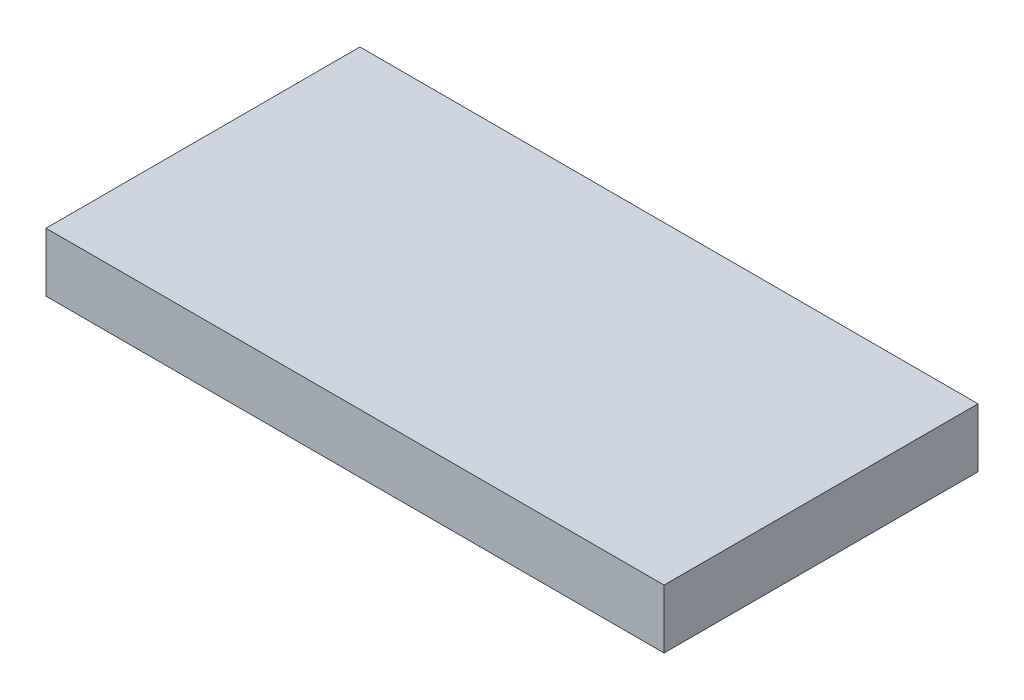
ISO-10303-21;
HEADER;
FILE_DESCRIPTION(('STEP AP214'),'2;1');
FILE_NAME('part.step','',(''),(''),'','','');
FILE_SCHEMA(('AUTOMOTIVE_DESIGN { 1 0 10303 214 1 1 1 1 }'));
ENDSEC;
DATA;
#1=APPLICATION_CONTEXT('core data for automotive mechanical design processes');
#2=APPLICATION_PROTOCOL_DEFINITION('international standard','automotive_design',2000,#1);
#3=PRODUCT_CONTEXT('',#1,'mechanical');
#4=PRODUCT('Part','Part','',(#3));
#5=PRODUCT_RELATED_PRODUCT_CATEGORY('part','',(#4));
#6=PRODUCT_DEFINITION_FORMATION('','',#4);
#7=PRODUCT_DEFINITION_CONTEXT('part definition',#1,'design');
#8=PRODUCT_DEFINITION('design','',#6,#7);
#9=PRODUCT_DEFINITION_SHAPE('','',#8);
#10=(LENGTH_UNIT() NAMED_UNIT(*) SI_UNIT(.MILLI.,.METRE.));
#11=(NAMED_UNIT(*) PLANE_ANGLE_UNIT() SI_UNIT($,.RADIAN.));
#12=(NAMED_UNIT(*) SI_UNIT($,.STERADIAN.) SOLID_ANGLE_UNIT());
#13=UNCERTAINTY_MEASURE_WITH_UNIT(LENGTH_MEASURE(1.E-05),#10,'distance_accuracy_value','');
#14=(GEOMETRIC_REPRESENTATION_CONTEXT(3) GLOBAL_UNCERTAINTY_ASSIGNED_CONTEXT((#13)) GLOBAL_UNIT_ASSIGNED_CONTEXT((#10,
#11,#12)) REPRESENTATION_CONTEXT('',''));
#15=CARTESIAN_POINT('',(0.,0.,0.));
#16=DIRECTION('',(0.,0.,1.));
#17=DIRECTION('',(1.,0.,0.));
#18=AXIS2_PLACEMENT_3D('',#15,#16,#17);
#19=CARTESIAN_POINT('',(0.,0.3,1.6));
#20=DIRECTION('',(0.,0.,1.));
#21=DIRECTION('',(1.,0.,0.));
#22=AXIS2_PLACEMENT_3D('',#19,#20,#21);
#23=PLANE('',#22);
#24=DIRECTION('',(-1.,0.,0.));
#25=VECTOR('',#24,1.);
#26=CARTESIAN_POINT('',(0.,-0.3,1.6));
#27=LINE('',#26,#25);
#28=CARTESIAN_POINT('',(3.15,-0.3,1.6));
#29=VERTEX_POINT('',#28);
#30=CARTESIAN_POINT('',(-3.15,-0.3,1.6));
#31=VERTEX_POINT('',#30);
#32=EDGE_CURVE('E98',#29,#31,#27,.T.);
#33=ORIENTED_EDGE('',*,*,#32,.F.);
#34=DIRECTION('',(0.,-1.,0.));
#35=VECTOR('',#34,1.);
#36=CARTESIAN_POINT('',(3.15,0.3,1.6));
#37=LINE('',#36,#35);
#38=CARTESIAN_POINT('',(3.15,0.3,1.6));
#39=VERTEX_POINT('',#38);
#40=EDGE_CURVE('E11',#39,#29,#37,.T.);
#41=ORIENTED_EDGE('',*,*,#40,.F.);
#42=DIRECTION('',(-1.,0.,0.));
#43=VECTOR('',#42,1.);
#44=CARTESIAN_POINT('',(0.,0.3,1.6));
#45=LINE('',#44,#43);
#46=CARTESIAN_POINT('',(-3.15,0.3,1.6));
#47=VERTEX_POINT('',#46);
#48=EDGE_CURVE('E83',#39,#47,#45,.T.);
#49=ORIENTED_EDGE('',*,*,#48,.T.);
#50=DIRECTION('',(0.,-1.,0.));
#51=VECTOR('',#50,1.);
#52=CARTESIAN_POINT('',(-3.15,0.3,1.6));
#53=LINE('',#52,#51);
#54=EDGE_CURVE('E51',#47,#31,#53,.T.);
#55=ORIENTED_EDGE('',*,*,#54,.T.);
#56=EDGE_LOOP('',(#33,#41,#49,#55));
#57=FACE_BOUND('',#56,.T.);
#58=ADVANCED_FACE('F35',(#57),#23,.T.);
#59=CARTESIAN_POINT('',(3.15,0.3,0.));
#60=DIRECTION('',(-1.,0.,0.));
#61=DIRECTION('',(0.,0.,1.));
#62=AXIS2_PLACEMENT_3D('',#59,#60,#61);
#63=PLANE('',#62);
#64=DIRECTION('',(0.,0.,-1.));
#65=VECTOR('',#64,1.);
#66=CARTESIAN_POINT('',(3.15,-0.3,0.));
#67=LINE('',#66,#65);
#68=CARTESIAN_POINT('',(3.15,-0.3,-1.6));
#69=VERTEX_POINT('',#68);
#70=EDGE_CURVE('E89',#29,#69,#67,.T.);
#71=ORIENTED_EDGE('',*,*,#70,.T.);
#72=DIRECTION('',(0.,-1.,0.));
#73=VECTOR('',#72,1.);
#74=CARTESIAN_POINT('',(3.15,0.3,-1.6));
#75=LINE('',#74,#73);
#76=CARTESIAN_POINT('',(3.15,0.3,-1.6));
#77=VERTEX_POINT('',#76);
#78=EDGE_CURVE('E43',#77,#69,#75,.T.);
#79=ORIENTED_EDGE('',*,*,#78,.F.);
#80=DIRECTION('',(0.,0.,-1.));
#81=VECTOR('',#80,1.);
#82=CARTESIAN_POINT('',(3.15,0.3,0.));
#83=LINE('',#82,#81);
#84=EDGE_CURVE('E77',#39,#77,#83,.T.);
#85=ORIENTED_EDGE('',*,*,#84,.F.);
#86=ORIENTED_EDGE('',*,*,#40,.T.);
#87=EDGE_LOOP('',(#71,#79,#85,#86));
#88=FACE_BOUND('',#87,.T.);
#89=ADVANCED_FACE('F87',(#88),#63,.F.);
#90=CARTESIAN_POINT('',(0.,0.3,-1.6));
#91=DIRECTION('',(0.,0.,1.));
#92=DIRECTION('',(1.,0.,0.));
#93=AXIS2_PLACEMENT_3D('',#90,#91,#92);
#94=PLANE('',#93);
#95=DIRECTION('',(-1.,0.,0.));
#96=VECTOR('',#95,1.);
#97=CARTESIAN_POINT('',(0.,-0.3,-1.6));
#98=LINE('',#97,#96);
#99=CARTESIAN_POINT('',(-3.15,-0.3,-1.6));
#100=VERTEX_POINT('',#99);
#101=EDGE_CURVE('E101',#69,#100,#98,.T.);
#102=ORIENTED_EDGE('',*,*,#101,.T.);
#103=DIRECTION('',(0.,-1.,0.));
#104=VECTOR('',#103,1.);
#105=CARTESIAN_POINT('',(-3.15,0.3,-1.6));
#106=LINE('',#105,#104);
#107=CARTESIAN_POINT('',(-3.15,0.3,-1.6));
#108=VERTEX_POINT('',#107);
#109=EDGE_CURVE('E65',#108,#100,#106,.T.);
#110=ORIENTED_EDGE('',*,*,#109,.F.);
#111=DIRECTION('',(-1.,0.,0.));
#112=VECTOR('',#111,1.);
#113=CARTESIAN_POINT('',(0.,0.3,-1.6));
#114=LINE('',#113,#112);
#115=EDGE_CURVE('E82',#77,#108,#114,.T.);
#116=ORIENTED_EDGE('',*,*,#115,.F.);
#117=ORIENTED_EDGE('',*,*,#78,.T.);
#118=EDGE_LOOP('',(#102,#110,#116,#117));
#119=FACE_BOUND('',#118,.T.);
#120=ADVANCED_FACE('F92',(#119),#94,.F.);
#121=CARTESIAN_POINT('',(-3.15,0.3,0.));
#122=DIRECTION('',(-1.,0.,0.));
#123=DIRECTION('',(0.,0.,1.));
#124=AXIS2_PLACEMENT_3D('',#121,#122,#123);
#125=PLANE('',#124);
#126=DIRECTION('',(0.,0.,-1.));
#127=VECTOR('',#126,1.);
#128=CARTESIAN_POINT('',(-3.15,-0.3,0.));
#129=LINE('',#128,#127);
#130=EDGE_CURVE('E103',#31,#100,#129,.T.);
#131=ORIENTED_EDGE('',*,*,#130,.F.);
#132=ORIENTED_EDGE('',*,*,#54,.F.);
#133=DIRECTION('',(0.,0.,-1.));
#134=VECTOR('',#133,1.);
#135=CARTESIAN_POINT('',(-3.15,0.3,0.));
#136=LINE('',#135,#134);
#137=EDGE_CURVE('E93',#47,#108,#136,.T.);
#138=ORIENTED_EDGE('',*,*,#137,.T.);
#139=ORIENTED_EDGE('',*,*,#109,.T.);
#140=EDGE_LOOP('',(#131,#132,#138,#139));
#141=FACE_BOUND('',#140,.T.);
#142=ADVANCED_FACE('F108',(#141),#125,.T.);
#143=CARTESIAN_POINT('',(0.,0.3,0.));
#144=DIRECTION('',(0.,1.,0.));
#145=DIRECTION('',(0.,0.,1.));
#146=AXIS2_PLACEMENT_3D('',#143,#144,#145);
#147=PLANE('',#146);
#148=ORIENTED_EDGE('',*,*,#48,.F.);
#149=ORIENTED_EDGE('',*,*,#84,.T.);
#150=ORIENTED_EDGE('',*,*,#115,.T.);
#151=ORIENTED_EDGE('',*,*,#137,.F.);
#152=EDGE_LOOP('',(#148,#149,#150,#151));
#153=FACE_BOUND('',#152,.T.);
#154=ADVANCED_FACE('F79',(#153),#147,.T.);
#155=CARTESIAN_POINT('',(0.,-0.3,0.));
#156=DIRECTION('',(0.,1.,0.));
#157=DIRECTION('',(0.,0.,1.));
#158=AXIS2_PLACEMENT_3D('',#155,#156,#157);
#159=PLANE('',#158);
#160=ORIENTED_EDGE('',*,*,#32,.T.);
#161=ORIENTED_EDGE('',*,*,#130,.T.);
#162=ORIENTED_EDGE('',*,*,#101,.F.);
#163=ORIENTED_EDGE('',*,*,#70,.F.);
#164=EDGE_LOOP('',(#160,#161,#162,#163));
#165=FACE_BOUND('',#164,.T.);
#166=ADVANCED_FACE('F115',(#165),#159,.F.);
#167=CLOSED_SHELL('',(#58,#89,#120,#142,#154,#166));
#168=MANIFOLD_SOLID_BREP('B2',#167);
#169=ADVANCED_BREP_SHAPE_REPRESENTATION('',(#18,#168),#14);
#170=SHAPE_DEFINITION_REPRESENTATION(#9,#169);
ENDSEC;
END-ISO-10303-21;
